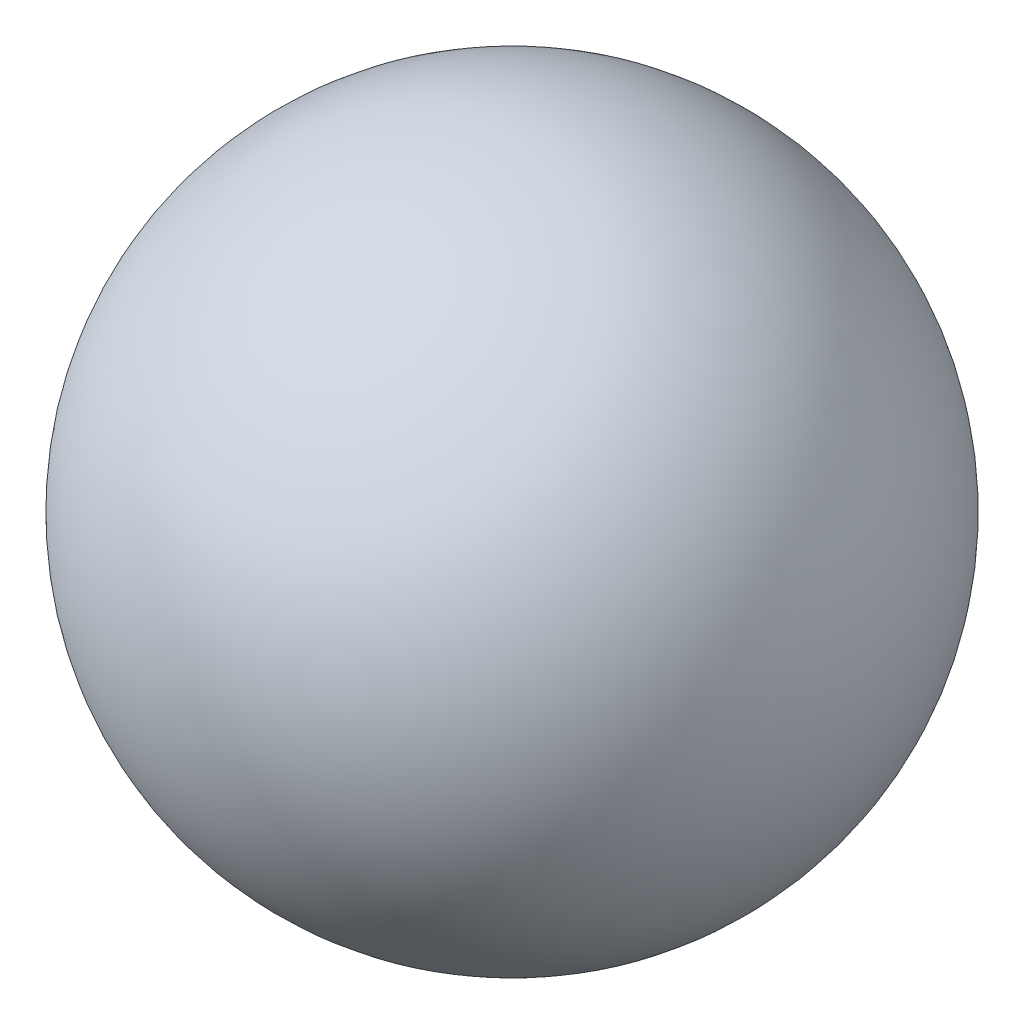
ISO-10303-21;
HEADER;
FILE_DESCRIPTION(('STEP AP214'),'2;1');
FILE_NAME('part.step','',(''),(''),'','','');
FILE_SCHEMA(('AUTOMOTIVE_DESIGN { 1 0 10303 214 1 1 1 1 }'));
ENDSEC;
DATA;
#1=APPLICATION_CONTEXT('core data for automotive mechanical design processes');
#2=APPLICATION_PROTOCOL_DEFINITION('international standard','automotive_design',2000,#1);
#3=PRODUCT_CONTEXT('',#1,'mechanical');
#4=PRODUCT('Part','Part','',(#3));
#5=PRODUCT_RELATED_PRODUCT_CATEGORY('part','',(#4));
#6=PRODUCT_DEFINITION_FORMATION('','',#4);
#7=PRODUCT_DEFINITION_CONTEXT('part definition',#1,'design');
#8=PRODUCT_DEFINITION('design','',#6,#7);
#9=PRODUCT_DEFINITION_SHAPE('','',#8);
#10=(LENGTH_UNIT() NAMED_UNIT(*) SI_UNIT(.MILLI.,.METRE.));
#11=(NAMED_UNIT(*) PLANE_ANGLE_UNIT() SI_UNIT($,.RADIAN.));
#12=(NAMED_UNIT(*) SI_UNIT($,.STERADIAN.) SOLID_ANGLE_UNIT());
#13=UNCERTAINTY_MEASURE_WITH_UNIT(LENGTH_MEASURE(1.E-05),#10,'distance_accuracy_value','');
#14=(GEOMETRIC_REPRESENTATION_CONTEXT(3) GLOBAL_UNCERTAINTY_ASSIGNED_CONTEXT((#13)) GLOBAL_UNIT_ASSIGNED_CONTEXT((#10,
#11,#12)) REPRESENTATION_CONTEXT('',''));
#15=CARTESIAN_POINT('',(0.,0.,0.));
#16=DIRECTION('',(0.,0.,1.));
#17=DIRECTION('',(1.,0.,0.));
#18=AXIS2_PLACEMENT_3D('',#15,#16,#17);
#19=CARTESIAN_POINT('',(0.,165.1,0.));
#20=DIRECTION('',(0.,1.,0.));
#21=DIRECTION('',(-1.,0.,0.));
#22=AXIS2_PLACEMENT_3D('',#19,#20,#21);
#23=SPHERICAL_SURFACE('',#22,165.1);
#24=CARTESIAN_POINT('',(0.,330.2,0.));
#25=VERTEX_POINT('',#24);
#26=VERTEX_LOOP('',#25);
#27=FACE_BOUND('',#26,.T.);
#28=ADVANCED_FACE('F33',(#27),#23,.T.);
#29=CLOSED_SHELL('',(#28));
#30=MANIFOLD_SOLID_BREP('B2',#29);
#31=ADVANCED_BREP_SHAPE_REPRESENTATION('',(#18,#30),#14);
#32=SHAPE_DEFINITION_REPRESENTATION(#9,#31);
ENDSEC;
END-ISO-10303-21;
